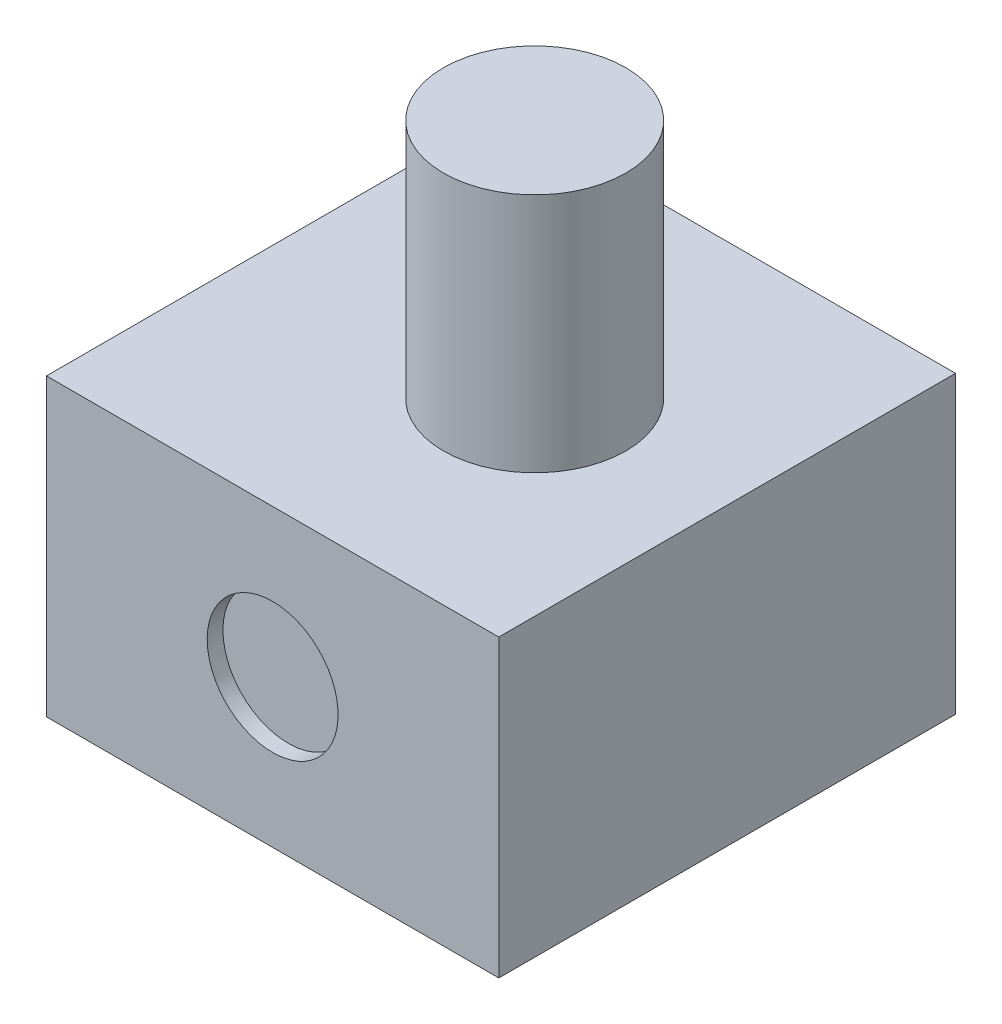
ISO-10303-21;
HEADER;
FILE_DESCRIPTION(('STEP AP214'),'2;1');
FILE_NAME('part.step','',(''),(''),'','','');
FILE_SCHEMA(('AUTOMOTIVE_DESIGN { 1 0 10303 214 1 1 1 1 }'));
ENDSEC;
DATA;
#1=APPLICATION_CONTEXT('core data for automotive mechanical design processes');
#2=APPLICATION_PROTOCOL_DEFINITION('international standard','automotive_design',2000,#1);
#3=PRODUCT_CONTEXT('',#1,'mechanical');
#4=PRODUCT('Part','Part','',(#3));
#5=PRODUCT_RELATED_PRODUCT_CATEGORY('part','',(#4));
#6=PRODUCT_DEFINITION_FORMATION('','',#4);
#7=PRODUCT_DEFINITION_CONTEXT('part definition',#1,'design');
#8=PRODUCT_DEFINITION('design','',#6,#7);
#9=PRODUCT_DEFINITION_SHAPE('','',#8);
#10=(LENGTH_UNIT() NAMED_UNIT(*) SI_UNIT(.MILLI.,.METRE.));
#11=(NAMED_UNIT(*) PLANE_ANGLE_UNIT() SI_UNIT($,.RADIAN.));
#12=(NAMED_UNIT(*) SI_UNIT($,.STERADIAN.) SOLID_ANGLE_UNIT());
#13=UNCERTAINTY_MEASURE_WITH_UNIT(LENGTH_MEASURE(1.E-05),#10,'distance_accuracy_value','');
#14=(GEOMETRIC_REPRESENTATION_CONTEXT(3) GLOBAL_UNCERTAINTY_ASSIGNED_CONTEXT((#13)) GLOBAL_UNIT_ASSIGNED_CONTEXT((#10,
#11,#12)) REPRESENTATION_CONTEXT('',''));
#15=CARTESIAN_POINT('',(0.,0.,0.));
#16=DIRECTION('',(0.,0.,1.));
#17=DIRECTION('',(1.,0.,0.));
#18=AXIS2_PLACEMENT_3D('',#15,#16,#17);
#19=CARTESIAN_POINT('',(0.,47.6758,0.));
#20=DIRECTION('',(1.,0.,0.));
#21=DIRECTION('',(0.,0.,-1.));
#22=AXIS2_PLACEMENT_3D('',#19,#20,#21);
#23=PLANE('',#22);
#24=DIRECTION('',(0.,0.,1.));
#25=VECTOR('',#24,1.);
#26=CARTESIAN_POINT('',(0.,0.,0.));
#27=LINE('',#26,#25);
#28=CARTESIAN_POINT('',(0.,0.,0.));
#29=VERTEX_POINT('',#28);
#30=CARTESIAN_POINT('',(0.,0.,73.7362));
#31=VERTEX_POINT('',#30);
#32=EDGE_CURVE('E115',#29,#31,#27,.T.);
#33=ORIENTED_EDGE('',*,*,#32,.T.);
#34=DIRECTION('',(0.,-1.,0.));
#35=VECTOR('',#34,1.);
#36=CARTESIAN_POINT('',(0.,47.6758,73.7362));
#37=LINE('',#36,#35);
#38=CARTESIAN_POINT('',(0.,47.6758,73.7362));
#39=VERTEX_POINT('',#38);
#40=EDGE_CURVE('E52',#39,#31,#37,.T.);
#41=ORIENTED_EDGE('',*,*,#40,.F.);
#42=DIRECTION('',(0.,0.,1.));
#43=VECTOR('',#42,1.);
#44=CARTESIAN_POINT('',(0.,47.6758,0.));
#45=LINE('',#44,#43);
#46=CARTESIAN_POINT('',(0.,47.6758,0.));
#47=VERTEX_POINT('',#46);
#48=EDGE_CURVE('E102',#47,#39,#45,.T.);
#49=ORIENTED_EDGE('',*,*,#48,.F.);
#50=DIRECTION('',(0.,-1.,0.));
#51=VECTOR('',#50,1.);
#52=CARTESIAN_POINT('',(0.,47.6758,0.));
#53=LINE('',#52,#51);
#54=EDGE_CURVE('E111',#47,#29,#53,.T.);
#55=ORIENTED_EDGE('',*,*,#54,.T.);
#56=EDGE_LOOP('',(#33,#41,#49,#55));
#57=FACE_BOUND('',#56,.T.);
#58=ADVANCED_FACE('F49',(#57),#23,.F.);
#59=CARTESIAN_POINT('',(0.,47.6758,73.7362));
#60=DIRECTION('',(0.,0.,-1.));
#61=DIRECTION('',(-1.,0.,0.));
#62=AXIS2_PLACEMENT_3D('',#59,#60,#61);
#63=PLANE('',#62);
#64=CARTESIAN_POINT('',(36.5125,23.8379,73.7362));
#65=DIRECTION('',(0.,0.,-1.));
#66=DIRECTION('',(-1.,0.,0.));
#67=AXIS2_PLACEMENT_3D('',#64,#65,#66);
#68=CIRCLE('',#67,10.5664);
#69=CARTESIAN_POINT('',(25.9461,23.8379,73.7362));
#70=VERTEX_POINT('',#69);
#71=EDGE_CURVE('E138',#70,#70,#68,.T.);
#72=ORIENTED_EDGE('',*,*,#71,.T.);
#73=EDGE_LOOP('',(#72));
#74=FACE_BOUND('',#73,.T.);
#75=DIRECTION('',(1.,0.,0.));
#76=VECTOR('',#75,1.);
#77=CARTESIAN_POINT('',(0.,0.,73.7362));
#78=LINE('',#77,#76);
#79=CARTESIAN_POINT('',(73.025,0.,73.7362));
#80=VERTEX_POINT('',#79);
#81=EDGE_CURVE('E107',#31,#80,#78,.T.);
#82=ORIENTED_EDGE('',*,*,#81,.T.);
#83=DIRECTION('',(0.,-1.,0.));
#84=VECTOR('',#83,1.);
#85=CARTESIAN_POINT('',(73.025,47.6758,73.7362));
#86=LINE('',#85,#84);
#87=CARTESIAN_POINT('',(73.025,47.6758,73.7362));
#88=VERTEX_POINT('',#87);
#89=EDGE_CURVE('E105',#88,#80,#86,.T.);
#90=ORIENTED_EDGE('',*,*,#89,.F.);
#91=DIRECTION('',(1.,0.,0.));
#92=VECTOR('',#91,1.);
#93=CARTESIAN_POINT('',(0.,47.6758,73.7362));
#94=LINE('',#93,#92);
#95=EDGE_CURVE('E97',#39,#88,#94,.T.);
#96=ORIENTED_EDGE('',*,*,#95,.F.);
#97=ORIENTED_EDGE('',*,*,#40,.T.);
#98=EDGE_LOOP('',(#82,#90,#96,#97));
#99=FACE_BOUND('',#98,.T.);
#100=ADVANCED_FACE('F106',(#74,#99),#63,.F.);
#101=CARTESIAN_POINT('',(73.025,47.6758,0.));
#102=DIRECTION('',(-1.,0.,0.));
#103=DIRECTION('',(0.,0.,1.));
#104=AXIS2_PLACEMENT_3D('',#101,#102,#103);
#105=PLANE('',#104);
#106=DIRECTION('',(0.,0.,-1.));
#107=VECTOR('',#106,1.);
#108=CARTESIAN_POINT('',(73.025,0.,0.));
#109=LINE('',#108,#107);
#110=CARTESIAN_POINT('',(73.025,0.,0.));
#111=VERTEX_POINT('',#110);
#112=EDGE_CURVE('E83',#80,#111,#109,.T.);
#113=ORIENTED_EDGE('',*,*,#112,.T.);
#114=DIRECTION('',(0.,-1.,0.));
#115=VECTOR('',#114,1.);
#116=CARTESIAN_POINT('',(73.025,47.6758,0.));
#117=LINE('',#116,#115);
#118=CARTESIAN_POINT('',(73.025,47.6758,0.));
#119=VERTEX_POINT('',#118);
#120=EDGE_CURVE('E108',#119,#111,#117,.T.);
#121=ORIENTED_EDGE('',*,*,#120,.F.);
#122=DIRECTION('',(0.,0.,-1.));
#123=VECTOR('',#122,1.);
#124=CARTESIAN_POINT('',(73.025,47.6758,0.));
#125=LINE('',#124,#123);
#126=EDGE_CURVE('E100',#88,#119,#125,.T.);
#127=ORIENTED_EDGE('',*,*,#126,.F.);
#128=ORIENTED_EDGE('',*,*,#89,.T.);
#129=EDGE_LOOP('',(#113,#121,#127,#128));
#130=FACE_BOUND('',#129,.T.);
#131=ADVANCED_FACE('F109',(#130),#105,.F.);
#132=CARTESIAN_POINT('',(0.,47.6758,0.));
#133=DIRECTION('',(0.,0.,1.));
#134=DIRECTION('',(1.,0.,0.));
#135=AXIS2_PLACEMENT_3D('',#132,#133,#134);
#136=PLANE('',#135);
#137=CARTESIAN_POINT('',(36.5125,23.8379,0.));
#138=DIRECTION('',(0.,0.,-1.));
#139=DIRECTION('',(-1.,0.,0.));
#140=AXIS2_PLACEMENT_3D('',#137,#138,#139);
#141=CIRCLE('',#140,10.5664);
#142=CARTESIAN_POINT('',(25.9461,23.8379,0.));
#143=VERTEX_POINT('',#142);
#144=EDGE_CURVE('E129',#143,#143,#141,.T.);
#145=ORIENTED_EDGE('',*,*,#144,.F.);
#146=EDGE_LOOP('',(#145));
#147=FACE_BOUND('',#146,.T.);
#148=DIRECTION('',(-1.,0.,0.));
#149=VECTOR('',#148,1.);
#150=CARTESIAN_POINT('',(0.,0.,0.));
#151=LINE('',#150,#149);
#152=EDGE_CURVE('E89',#111,#29,#151,.T.);
#153=ORIENTED_EDGE('',*,*,#152,.T.);
#154=ORIENTED_EDGE('',*,*,#54,.F.);
#155=DIRECTION('',(-1.,0.,0.));
#156=VECTOR('',#155,1.);
#157=CARTESIAN_POINT('',(0.,47.6758,0.));
#158=LINE('',#157,#156);
#159=EDGE_CURVE('E66',#119,#47,#158,.T.);
#160=ORIENTED_EDGE('',*,*,#159,.F.);
#161=ORIENTED_EDGE('',*,*,#120,.T.);
#162=EDGE_LOOP('',(#153,#154,#160,#161));
#163=FACE_BOUND('',#162,.T.);
#164=ADVANCED_FACE('F123',(#147,#163),#136,.F.);
#165=CARTESIAN_POINT('',(0.,47.6758,0.));
#166=DIRECTION('',(0.,1.,0.));
#167=DIRECTION('',(0.,0.,1.));
#168=AXIS2_PLACEMENT_3D('',#165,#166,#167);
#169=PLANE('',#168);
#170=CARTESIAN_POINT('',(42.545,47.6758,37.465));
#171=DIRECTION('',(0.,1.,0.));
#172=DIRECTION('',(0.,0.,1.));
#173=AXIS2_PLACEMENT_3D('',#170,#171,#172);
#174=CIRCLE('',#173,14.732);
#175=CARTESIAN_POINT('',(42.545,47.6758,52.197));
#176=VERTEX_POINT('',#175);
#177=EDGE_CURVE('E13',#176,#176,#174,.T.);
#178=ORIENTED_EDGE('',*,*,#177,.F.);
#179=EDGE_LOOP('',(#178));
#180=FACE_BOUND('',#179,.T.);
#181=ORIENTED_EDGE('',*,*,#48,.T.);
#182=ORIENTED_EDGE('',*,*,#95,.T.);
#183=ORIENTED_EDGE('',*,*,#126,.T.);
#184=ORIENTED_EDGE('',*,*,#159,.T.);
#185=EDGE_LOOP('',(#181,#182,#183,#184));
#186=FACE_BOUND('',#185,.T.);
#187=ADVANCED_FACE('F98',(#180,#186),#169,.T.);
#188=CARTESIAN_POINT('',(0.,0.,0.));
#189=DIRECTION('',(0.,1.,0.));
#190=DIRECTION('',(0.,0.,1.));
#191=AXIS2_PLACEMENT_3D('',#188,#189,#190);
#192=PLANE('',#191);
#193=ORIENTED_EDGE('',*,*,#32,.F.);
#194=ORIENTED_EDGE('',*,*,#152,.F.);
#195=ORIENTED_EDGE('',*,*,#112,.F.);
#196=ORIENTED_EDGE('',*,*,#81,.F.);
#197=EDGE_LOOP('',(#193,#194,#195,#196));
#198=FACE_BOUND('',#197,.T.);
#199=ADVANCED_FACE('F126',(#198),#192,.F.);
#200=CARTESIAN_POINT('',(36.5125,23.8379,2.54));
#201=DIRECTION('',(0.,0.,-1.));
#202=DIRECTION('',(-1.,0.,0.));
#203=AXIS2_PLACEMENT_3D('',#200,#201,#202);
#204=CYLINDRICAL_SURFACE('',#203,10.5664);
#205=CARTESIAN_POINT('',(36.5125,23.8379,2.54));
#206=DIRECTION('',(0.,0.,-1.));
#207=DIRECTION('',(-1.,0.,0.));
#208=AXIS2_PLACEMENT_3D('',#205,#206,#207);
#209=CIRCLE('',#208,10.5664);
#210=CARTESIAN_POINT('',(25.9461,23.8379,2.54));
#211=VERTEX_POINT('',#210);
#212=EDGE_CURVE('E118',#211,#211,#209,.T.);
#213=ORIENTED_EDGE('',*,*,#212,.F.);
#214=EDGE_LOOP('',(#213));
#215=FACE_BOUND('',#214,.T.);
#216=ORIENTED_EDGE('',*,*,#144,.T.);
#217=EDGE_LOOP('',(#216));
#218=FACE_BOUND('',#217,.T.);
#219=ADVANCED_FACE('F170',(#215,#218),#204,.F.);
#220=CARTESIAN_POINT('',(36.5125,23.8379,2.54));
#221=DIRECTION('',(0.,0.,-1.));
#222=DIRECTION('',(-1.,0.,0.));
#223=AXIS2_PLACEMENT_3D('',#220,#221,#222);
#224=PLANE('',#223);
#225=ORIENTED_EDGE('',*,*,#212,.T.);
#226=EDGE_LOOP('',(#225));
#227=FACE_BOUND('',#226,.T.);
#228=ADVANCED_FACE('F176',(#227),#224,.T.);
#229=CARTESIAN_POINT('',(42.545,86.5378,37.465));
#230=DIRECTION('',(0.,-1.,0.));
#231=DIRECTION('',(0.,0.,-1.));
#232=AXIS2_PLACEMENT_3D('',#229,#230,#231);
#233=CYLINDRICAL_SURFACE('',#232,14.732);
#234=CARTESIAN_POINT('',(42.545,86.5378,37.465));
#235=DIRECTION('',(0.,1.,0.));
#236=DIRECTION('',(0.,0.,1.));
#237=AXIS2_PLACEMENT_3D('',#234,#235,#236);
#238=CIRCLE('',#237,14.732);
#239=CARTESIAN_POINT('',(42.545,86.5378,52.197));
#240=VERTEX_POINT('',#239);
#241=EDGE_CURVE('E132',#240,#240,#238,.T.);
#242=ORIENTED_EDGE('',*,*,#241,.F.);
#243=EDGE_LOOP('',(#242));
#244=FACE_BOUND('',#243,.T.);
#245=ORIENTED_EDGE('',*,*,#177,.T.);
#246=EDGE_LOOP('',(#245));
#247=FACE_BOUND('',#246,.T.);
#248=ADVANCED_FACE('F180',(#244,#247),#233,.T.);
#249=CARTESIAN_POINT('',(42.545,86.5378,37.465));
#250=DIRECTION('',(0.,1.,0.));
#251=DIRECTION('',(0.,0.,1.));
#252=AXIS2_PLACEMENT_3D('',#249,#250,#251);
#253=PLANE('',#252);
#254=ORIENTED_EDGE('',*,*,#241,.T.);
#255=EDGE_LOOP('',(#254));
#256=FACE_BOUND('',#255,.T.);
#257=ADVANCED_FACE('F153',(#256),#253,.T.);
#258=CARTESIAN_POINT('',(36.5125,23.8379,71.1962));
#259=DIRECTION('',(0.,0.,1.));
#260=DIRECTION('',(1.,0.,0.));
#261=AXIS2_PLACEMENT_3D('',#258,#259,#260);
#262=CYLINDRICAL_SURFACE('',#261,10.5664);
#263=CARTESIAN_POINT('',(36.5125,23.8379,71.1962));
#264=DIRECTION('',(0.,0.,-1.));
#265=DIRECTION('',(-1.,0.,0.));
#266=AXIS2_PLACEMENT_3D('',#263,#264,#265);
#267=CIRCLE('',#266,10.5664);
#268=CARTESIAN_POINT('',(25.9461,23.8379,71.1962));
#269=VERTEX_POINT('',#268);
#270=EDGE_CURVE('E137',#269,#269,#267,.T.);
#271=ORIENTED_EDGE('',*,*,#270,.T.);
#272=EDGE_LOOP('',(#271));
#273=FACE_BOUND('',#272,.T.);
#274=ORIENTED_EDGE('',*,*,#71,.F.);
#275=EDGE_LOOP('',(#274));
#276=FACE_BOUND('',#275,.T.);
#277=ADVANCED_FACE('F144',(#273,#276),#262,.F.);
#278=CARTESIAN_POINT('',(36.5125,23.8379,71.1962));
#279=DIRECTION('',(0.,0.,1.));
#280=DIRECTION('',(-1.,0.,0.));
#281=AXIS2_PLACEMENT_3D('',#278,#279,#280);
#282=PLANE('',#281);
#283=ORIENTED_EDGE('',*,*,#270,.F.);
#284=EDGE_LOOP('',(#283));
#285=FACE_BOUND('',#284,.T.);
#286=ADVANCED_FACE('F147',(#285),#282,.T.);
#287=CLOSED_SHELL('',(#58,#100,#131,#164,#187,#199,#219,#228,#248,#257,#277,#286));
#288=MANIFOLD_SOLID_BREP('B2',#287);
#289=ADVANCED_BREP_SHAPE_REPRESENTATION('',(#18,#288),#14);
#290=SHAPE_DEFINITION_REPRESENTATION(#9,#289);
ENDSEC;
END-ISO-10303-21;
